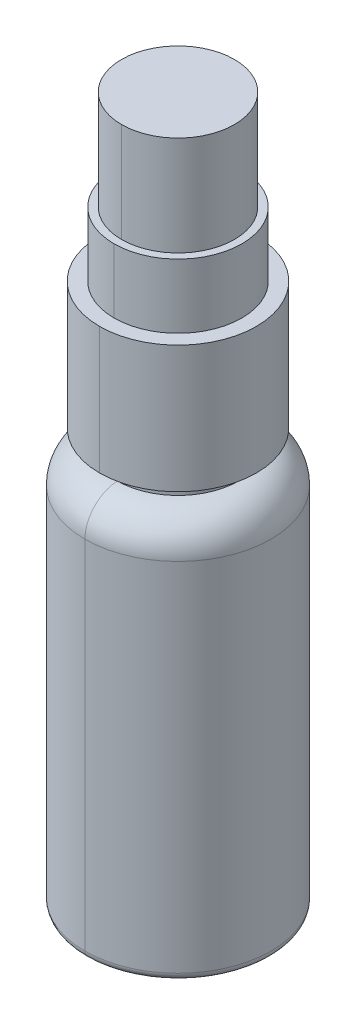
ISO-10303-21;
HEADER;
FILE_DESCRIPTION(('STEP AP214'),'2;1');
FILE_NAME('part.step','',(''),(''),'','','');
FILE_SCHEMA(('AUTOMOTIVE_DESIGN { 1 0 10303 214 1 1 1 1 }'));
ENDSEC;
DATA;
#1=APPLICATION_CONTEXT('core data for automotive mechanical design processes');
#2=APPLICATION_PROTOCOL_DEFINITION('international standard','automotive_design',2000,#1);
#3=PRODUCT_CONTEXT('',#1,'mechanical');
#4=PRODUCT('Part','Part','',(#3));
#5=PRODUCT_RELATED_PRODUCT_CATEGORY('part','',(#4));
#6=PRODUCT_DEFINITION_FORMATION('','',#4);
#7=PRODUCT_DEFINITION_CONTEXT('part definition',#1,'design');
#8=PRODUCT_DEFINITION('design','',#6,#7);
#9=PRODUCT_DEFINITION_SHAPE('','',#8);
#10=(LENGTH_UNIT() NAMED_UNIT(*) SI_UNIT(.MILLI.,.METRE.));
#11=(NAMED_UNIT(*) PLANE_ANGLE_UNIT() SI_UNIT($,.RADIAN.));
#12=(NAMED_UNIT(*) SI_UNIT($,.STERADIAN.) SOLID_ANGLE_UNIT());
#13=UNCERTAINTY_MEASURE_WITH_UNIT(LENGTH_MEASURE(1.E-05),#10,'distance_accuracy_value','');
#14=(GEOMETRIC_REPRESENTATION_CONTEXT(3) GLOBAL_UNCERTAINTY_ASSIGNED_CONTEXT((#13)) GLOBAL_UNIT_ASSIGNED_CONTEXT((#10,
#11,#12)) REPRESENTATION_CONTEXT('',''));
#15=CARTESIAN_POINT('',(0.,0.,0.));
#16=DIRECTION('',(0.,0.,1.));
#17=DIRECTION('',(1.,0.,0.));
#18=AXIS2_PLACEMENT_3D('',#15,#16,#17);
#19=CARTESIAN_POINT('',(0.,46.5,0.));
#20=DIRECTION('',(0.,1.,0.));
#21=DIRECTION('',(0.,0.,1.));
#22=AXIS2_PLACEMENT_3D('',#19,#20,#21);
#23=TOROIDAL_SURFACE('',#22,7.5,4.375);
#24=CARTESIAN_POINT('',(0.,46.5,-7.5));
#25=DIRECTION('',(1.,0.,0.));
#26=DIRECTION('',(0.,0.,-1.));
#27=AXIS2_PLACEMENT_3D('',#24,#25,#26);
#28=CIRCLE('',#27,4.375);
#29=CARTESIAN_POINT('',(0.,46.5,-11.875));
#30=VERTEX_POINT('',#29);
#31=CARTESIAN_POINT('',(0.,50.875,-7.5));
#32=VERTEX_POINT('',#31);
#33=EDGE_CURVE('E360',#30,#32,#28,.T.);
#34=ORIENTED_EDGE('',*,*,#33,.F.);
#35=CARTESIAN_POINT('',(0.,46.5,0.));
#36=DIRECTION('',(0.,1.,0.));
#37=DIRECTION('',(0.,0.,1.));
#38=AXIS2_PLACEMENT_3D('',#35,#36,#37);
#39=CIRCLE('',#38,11.875);
#40=CARTESIAN_POINT('',(0.,46.5,11.875));
#41=VERTEX_POINT('',#40);
#42=EDGE_CURVE('E11',#30,#41,#39,.T.);
#43=ORIENTED_EDGE('',*,*,#42,.T.);
#44=CARTESIAN_POINT('',(0.,46.5,7.5));
#45=DIRECTION('',(-1.,0.,0.));
#46=DIRECTION('',(0.,0.,1.));
#47=AXIS2_PLACEMENT_3D('',#44,#45,#46);
#48=CIRCLE('',#47,4.375);
#49=CARTESIAN_POINT('',(0.,50.875,7.5));
#50=VERTEX_POINT('',#49);
#51=EDGE_CURVE('E200',#41,#50,#48,.T.);
#52=ORIENTED_EDGE('',*,*,#51,.T.);
#53=CARTESIAN_POINT('',(0.,50.875,0.));
#54=DIRECTION('',(0.,1.,0.));
#55=DIRECTION('',(0.,0.,1.));
#56=AXIS2_PLACEMENT_3D('',#53,#54,#55);
#57=CIRCLE('',#56,7.5);
#58=EDGE_CURVE('E246',#32,#50,#57,.T.);
#59=ORIENTED_EDGE('',*,*,#58,.F.);
#60=EDGE_LOOP('',(#34,#43,#52,#59));
#61=FACE_BOUND('',#60,.T.);
#62=ADVANCED_FACE('F16',(#61),#23,.T.);
#63=CARTESIAN_POINT('',(0.,65.8,0.));
#64=DIRECTION('',(0.,1.,0.));
#65=DIRECTION('',(0.,0.,1.));
#66=AXIS2_PLACEMENT_3D('',#63,#64,#65);
#67=CYLINDRICAL_SURFACE('',#66,11.875);
#68=DIRECTION('',(0.,1.,0.));
#69=VECTOR('',#68,1.);
#70=CARTESIAN_POINT('',(0.,65.8,-11.875));
#71=LINE('',#70,#69);
#72=CARTESIAN_POINT('',(0.,1.,-11.875));
#73=VERTEX_POINT('',#72);
#74=EDGE_CURVE('E191',#73,#30,#71,.T.);
#75=ORIENTED_EDGE('',*,*,#74,.F.);
#76=CARTESIAN_POINT('',(0.,1.,0.));
#77=DIRECTION('',(0.,1.,0.));
#78=DIRECTION('',(0.,0.,1.));
#79=AXIS2_PLACEMENT_3D('',#76,#77,#78);
#80=CIRCLE('',#79,11.875);
#81=CARTESIAN_POINT('',(0.,1.,11.875));
#82=VERTEX_POINT('',#81);
#83=EDGE_CURVE('E25',#73,#82,#80,.T.);
#84=ORIENTED_EDGE('',*,*,#83,.T.);
#85=DIRECTION('',(0.,1.,0.));
#86=VECTOR('',#85,1.);
#87=CARTESIAN_POINT('',(0.,65.8,11.875));
#88=LINE('',#87,#86);
#89=EDGE_CURVE('E196',#82,#41,#88,.T.);
#90=ORIENTED_EDGE('',*,*,#89,.T.);
#91=ORIENTED_EDGE('',*,*,#42,.F.);
#92=EDGE_LOOP('',(#75,#84,#90,#91));
#93=FACE_BOUND('',#92,.T.);
#94=ADVANCED_FACE('F18',(#93),#67,.T.);
#95=CARTESIAN_POINT('',(0.,1.,0.));
#96=DIRECTION('',(0.,1.,0.));
#97=DIRECTION('',(0.,0.,1.));
#98=AXIS2_PLACEMENT_3D('',#95,#96,#97);
#99=TOROIDAL_SURFACE('',#98,10.875,1.);
#100=CARTESIAN_POINT('',(0.,1.,-10.875));
#101=DIRECTION('',(1.,0.,0.));
#102=DIRECTION('',(0.,0.,-1.));
#103=AXIS2_PLACEMENT_3D('',#100,#101,#102);
#104=CIRCLE('',#103,1.);
#105=CARTESIAN_POINT('',(0.,0.,-10.875));
#106=VERTEX_POINT('',#105);
#107=EDGE_CURVE('E170',#106,#73,#104,.T.);
#108=ORIENTED_EDGE('',*,*,#107,.F.);
#109=CARTESIAN_POINT('',(0.,0.,0.));
#110=DIRECTION('',(0.,1.,0.));
#111=DIRECTION('',(0.,0.,1.));
#112=AXIS2_PLACEMENT_3D('',#109,#110,#111);
#113=CIRCLE('',#112,10.875);
#114=CARTESIAN_POINT('',(0.,0.,10.875));
#115=VERTEX_POINT('',#114);
#116=EDGE_CURVE('E179',#106,#115,#113,.T.);
#117=ORIENTED_EDGE('',*,*,#116,.T.);
#118=CARTESIAN_POINT('',(0.,1.,10.875));
#119=DIRECTION('',(-1.,0.,0.));
#120=DIRECTION('',(0.,0.,1.));
#121=AXIS2_PLACEMENT_3D('',#118,#119,#120);
#122=CIRCLE('',#121,1.);
#123=EDGE_CURVE('E173',#115,#82,#122,.T.);
#124=ORIENTED_EDGE('',*,*,#123,.T.);
#125=ORIENTED_EDGE('',*,*,#83,.F.);
#126=EDGE_LOOP('',(#108,#117,#124,#125));
#127=FACE_BOUND('',#126,.T.);
#128=ADVANCED_FACE('F169',(#127),#99,.T.);
#129=CARTESIAN_POINT('',(9.75,0.,0.));
#130=DIRECTION('',(0.,1.,0.));
#131=DIRECTION('',(1.,0.,0.));
#132=AXIS2_PLACEMENT_3D('',#129,#130,#131);
#133=PLANE('',#132);
#134=CARTESIAN_POINT('',(0.,0.,0.));
#135=DIRECTION('',(0.,1.,0.));
#136=DIRECTION('',(0.,0.,1.));
#137=AXIS2_PLACEMENT_3D('',#134,#135,#136);
#138=CIRCLE('',#137,9.75);
#139=CARTESIAN_POINT('',(0.,0.,9.75));
#140=VERTEX_POINT('',#139);
#141=CARTESIAN_POINT('',(0.,0.,-9.75));
#142=VERTEX_POINT('',#141);
#143=EDGE_CURVE('E226',#140,#142,#138,.T.);
#144=ORIENTED_EDGE('',*,*,#143,.T.);
#145=CARTESIAN_POINT('',(0.,0.,0.));
#146=DIRECTION('',(0.,1.,0.));
#147=DIRECTION('',(0.,0.,1.));
#148=AXIS2_PLACEMENT_3D('',#145,#146,#147);
#149=CIRCLE('',#148,9.75);
#150=EDGE_CURVE('E346',#142,#140,#149,.T.);
#151=ORIENTED_EDGE('',*,*,#150,.T.);
#152=EDGE_LOOP('',(#144,#151));
#153=FACE_BOUND('',#152,.T.);
#154=CARTESIAN_POINT('',(0.,0.,0.));
#155=DIRECTION('',(0.,1.,0.));
#156=DIRECTION('',(0.,0.,1.));
#157=AXIS2_PLACEMENT_3D('',#154,#155,#156);
#158=CIRCLE('',#157,10.875);
#159=EDGE_CURVE('E187',#115,#106,#158,.T.);
#160=ORIENTED_EDGE('',*,*,#159,.F.);
#161=ORIENTED_EDGE('',*,*,#116,.F.);
#162=EDGE_LOOP('',(#160,#161));
#163=FACE_BOUND('',#162,.T.);
#164=ADVANCED_FACE('F399',(#153,#163),#133,.F.);
#165=CARTESIAN_POINT('',(0.,1.,0.));
#166=DIRECTION('',(0.,1.,0.));
#167=DIRECTION('',(0.,0.,1.));
#168=AXIS2_PLACEMENT_3D('',#165,#166,#167);
#169=TOROIDAL_SURFACE('',#168,9.75,1.);
#170=CARTESIAN_POINT('',(0.,1.,-9.75));
#171=DIRECTION('',(1.,0.,0.));
#172=DIRECTION('',(0.,0.,-1.));
#173=AXIS2_PLACEMENT_3D('',#170,#171,#172);
#174=CIRCLE('',#173,1.);
#175=CARTESIAN_POINT('',(0.,1.,-8.75));
#176=VERTEX_POINT('',#175);
#177=EDGE_CURVE('E230',#176,#142,#174,.T.);
#178=ORIENTED_EDGE('',*,*,#177,.F.);
#179=CARTESIAN_POINT('',(0.,1.,0.));
#180=DIRECTION('',(0.,1.,0.));
#181=DIRECTION('',(0.,0.,1.));
#182=AXIS2_PLACEMENT_3D('',#179,#180,#181);
#183=CIRCLE('',#182,8.75);
#184=CARTESIAN_POINT('',(0.,1.,8.75));
#185=VERTEX_POINT('',#184);
#186=EDGE_CURVE('E211',#176,#185,#183,.T.);
#187=ORIENTED_EDGE('',*,*,#186,.T.);
#188=CARTESIAN_POINT('',(0.,1.,9.75));
#189=DIRECTION('',(-1.,0.,0.));
#190=DIRECTION('',(0.,0.,1.));
#191=AXIS2_PLACEMENT_3D('',#188,#189,#190);
#192=CIRCLE('',#191,1.);
#193=EDGE_CURVE('E216',#185,#140,#192,.T.);
#194=ORIENTED_EDGE('',*,*,#193,.T.);
#195=ORIENTED_EDGE('',*,*,#150,.F.);
#196=EDGE_LOOP('',(#178,#187,#194,#195));
#197=FACE_BOUND('',#196,.T.);
#198=ADVANCED_FACE('F398',(#197),#169,.T.);
#199=CARTESIAN_POINT('',(0.,65.8,0.));
#200=DIRECTION('',(0.,1.,0.));
#201=DIRECTION('',(0.,0.,1.));
#202=AXIS2_PLACEMENT_3D('',#199,#200,#201);
#203=CYLINDRICAL_SURFACE('',#202,8.75);
#204=DIRECTION('',(0.,1.,0.));
#205=VECTOR('',#204,1.);
#206=CARTESIAN_POINT('',(0.,65.8,-8.75));
#207=LINE('',#206,#205);
#208=CARTESIAN_POINT('',(0.,1.40955855165527,-8.75));
#209=VERTEX_POINT('',#208);
#210=EDGE_CURVE('E215',#176,#209,#207,.T.);
#211=ORIENTED_EDGE('',*,*,#210,.F.);
#212=CARTESIAN_POINT('',(0.,1.,0.));
#213=DIRECTION('',(0.,1.,0.));
#214=DIRECTION('',(0.,0.,1.));
#215=AXIS2_PLACEMENT_3D('',#212,#213,#214);
#216=CIRCLE('',#215,8.75);
#217=EDGE_CURVE('E233',#185,#176,#216,.T.);
#218=ORIENTED_EDGE('',*,*,#217,.F.);
#219=DIRECTION('',(0.,1.,0.));
#220=VECTOR('',#219,1.);
#221=CARTESIAN_POINT('',(0.,65.8,8.75));
#222=LINE('',#221,#220);
#223=CARTESIAN_POINT('',(0.,1.40955855165527,8.75));
#224=VERTEX_POINT('',#223);
#225=EDGE_CURVE('E239',#185,#224,#222,.T.);
#226=ORIENTED_EDGE('',*,*,#225,.T.);
#227=CARTESIAN_POINT('',(0.,1.40955855165527,0.));
#228=DIRECTION('',(0.,1.,0.));
#229=DIRECTION('',(0.,0.,1.));
#230=AXIS2_PLACEMENT_3D('',#227,#228,#229);
#231=CIRCLE('',#230,8.75);
#232=EDGE_CURVE('E345',#224,#209,#231,.T.);
#233=ORIENTED_EDGE('',*,*,#232,.T.);
#234=EDGE_LOOP('',(#211,#218,#226,#233));
#235=FACE_BOUND('',#234,.T.);
#236=ADVANCED_FACE('F393',(#235),#203,.F.);
#237=CARTESIAN_POINT('',(0.,1.40955855165527,0.));
#238=DIRECTION('',(0.,1.,0.));
#239=DIRECTION('',(0.,0.,1.));
#240=AXIS2_PLACEMENT_3D('',#237,#238,#239);
#241=TOROIDAL_SURFACE('',#240,7.75,1.);
#242=CARTESIAN_POINT('',(0.,1.40955855165527,-7.75));
#243=DIRECTION('',(1.,0.,0.));
#244=DIRECTION('',(0.,0.,-1.));
#245=AXIS2_PLACEMENT_3D('',#242,#243,#244);
#246=CIRCLE('',#245,1.);
#247=CARTESIAN_POINT('',(0.,2.40955855165527,-7.75));
#248=VERTEX_POINT('',#247);
#249=EDGE_CURVE('E234',#209,#248,#246,.T.);
#250=ORIENTED_EDGE('',*,*,#249,.F.);
#251=ORIENTED_EDGE('',*,*,#232,.F.);
#252=CARTESIAN_POINT('',(0.,1.40955855165527,7.75));
#253=DIRECTION('',(-1.,0.,0.));
#254=DIRECTION('',(0.,0.,1.));
#255=AXIS2_PLACEMENT_3D('',#252,#253,#254);
#256=CIRCLE('',#255,1.);
#257=CARTESIAN_POINT('',(0.,2.40955855165527,7.75));
#258=VERTEX_POINT('',#257);
#259=EDGE_CURVE('E272',#224,#258,#256,.T.);
#260=ORIENTED_EDGE('',*,*,#259,.T.);
#261=CARTESIAN_POINT('',(0.,2.40955855165527,0.));
#262=DIRECTION('',(0.,1.,0.));
#263=DIRECTION('',(0.,0.,1.));
#264=AXIS2_PLACEMENT_3D('',#261,#262,#263);
#265=CIRCLE('',#264,7.75);
#266=EDGE_CURVE('E343',#258,#248,#265,.T.);
#267=ORIENTED_EDGE('',*,*,#266,.T.);
#268=EDGE_LOOP('',(#250,#251,#260,#267));
#269=FACE_BOUND('',#268,.T.);
#270=ADVANCED_FACE('F420',(#269),#241,.F.);
#271=CARTESIAN_POINT('',(7.75,2.40955855165527,0.));
#272=DIRECTION('',(0.,-1.,0.));
#273=DIRECTION('',(0.,0.,-1.));
#274=AXIS2_PLACEMENT_3D('',#271,#272,#273);
#275=PLANE('',#274);
#276=ORIENTED_EDGE('',*,*,#266,.F.);
#277=CARTESIAN_POINT('',(0.,2.40955855165527,0.));
#278=DIRECTION('',(0.,1.,0.));
#279=DIRECTION('',(0.,0.,1.));
#280=AXIS2_PLACEMENT_3D('',#277,#278,#279);
#281=CIRCLE('',#280,7.75);
#282=EDGE_CURVE('E238',#248,#258,#281,.T.);
#283=ORIENTED_EDGE('',*,*,#282,.F.);
#284=EDGE_LOOP('',(#276,#283));
#285=FACE_BOUND('',#284,.T.);
#286=ADVANCED_FACE('F421',(#285),#275,.T.);
#287=CARTESIAN_POINT('',(0.,89.975,0.));
#288=DIRECTION('',(0.,1.,0.));
#289=DIRECTION('',(1.,0.,0.));
#290=AXIS2_PLACEMENT_3D('',#287,#288,#289);
#291=PLANE('',#290);
#292=CARTESIAN_POINT('',(0.,89.975,0.));
#293=DIRECTION('',(0.,1.,0.));
#294=DIRECTION('',(0.,0.,1.));
#295=AXIS2_PLACEMENT_3D('',#292,#293,#294);
#296=CIRCLE('',#295,7.2);
#297=CARTESIAN_POINT('',(0.,89.975,7.2));
#298=VERTEX_POINT('',#297);
#299=CARTESIAN_POINT('',(0.,89.975,-7.2));
#300=VERTEX_POINT('',#299);
#301=EDGE_CURVE('E248',#298,#300,#296,.T.);
#302=ORIENTED_EDGE('',*,*,#301,.T.);
#303=CARTESIAN_POINT('',(0.,89.975,0.));
#304=DIRECTION('',(0.,1.,0.));
#305=DIRECTION('',(0.,0.,1.));
#306=AXIS2_PLACEMENT_3D('',#303,#304,#305);
#307=CIRCLE('',#306,7.2);
#308=EDGE_CURVE('E261',#300,#298,#307,.T.);
#309=ORIENTED_EDGE('',*,*,#308,.T.);
#310=EDGE_LOOP('',(#302,#309));
#311=FACE_BOUND('',#310,.T.);
#312=ADVANCED_FACE('F424',(#311),#291,.T.);
#313=CARTESIAN_POINT('',(0.,65.8,0.));
#314=DIRECTION('',(0.,1.,0.));
#315=DIRECTION('',(0.,0.,1.));
#316=AXIS2_PLACEMENT_3D('',#313,#314,#315);
#317=CYLINDRICAL_SURFACE('',#316,7.2);
#318=DIRECTION('',(0.,1.,0.));
#319=VECTOR('',#318,1.);
#320=CARTESIAN_POINT('',(0.,65.8,-7.2));
#321=LINE('',#320,#319);
#322=CARTESIAN_POINT('',(0.,77.275,-7.2));
#323=VERTEX_POINT('',#322);
#324=EDGE_CURVE('E253',#323,#300,#321,.T.);
#325=ORIENTED_EDGE('',*,*,#324,.F.);
#326=CARTESIAN_POINT('',(0.,77.275,0.));
#327=DIRECTION('',(0.,1.,0.));
#328=DIRECTION('',(0.,0.,1.));
#329=AXIS2_PLACEMENT_3D('',#326,#327,#328);
#330=CIRCLE('',#329,7.2);
#331=CARTESIAN_POINT('',(0.,77.275,7.2));
#332=VERTEX_POINT('',#331);
#333=EDGE_CURVE('E258',#323,#332,#330,.T.);
#334=ORIENTED_EDGE('',*,*,#333,.T.);
#335=DIRECTION('',(0.,1.,0.));
#336=VECTOR('',#335,1.);
#337=CARTESIAN_POINT('',(0.,65.8,7.2));
#338=LINE('',#337,#336);
#339=EDGE_CURVE('E252',#332,#298,#338,.T.);
#340=ORIENTED_EDGE('',*,*,#339,.T.);
#341=ORIENTED_EDGE('',*,*,#308,.F.);
#342=EDGE_LOOP('',(#325,#334,#340,#341));
#343=FACE_BOUND('',#342,.T.);
#344=ADVANCED_FACE('F428',(#343),#317,.T.);
#345=CARTESIAN_POINT('',(8.15,77.275,0.));
#346=DIRECTION('',(0.,-1.,0.));
#347=DIRECTION('',(0.,0.,-1.));
#348=AXIS2_PLACEMENT_3D('',#345,#346,#347);
#349=PLANE('',#348);
#350=CARTESIAN_POINT('',(0.,77.275,0.));
#351=DIRECTION('',(0.,1.,0.));
#352=DIRECTION('',(0.,0.,1.));
#353=AXIS2_PLACEMENT_3D('',#350,#351,#352);
#354=CIRCLE('',#353,7.2);
#355=EDGE_CURVE('E276',#332,#323,#354,.T.);
#356=ORIENTED_EDGE('',*,*,#355,.F.);
#357=ORIENTED_EDGE('',*,*,#333,.F.);
#358=EDGE_LOOP('',(#356,#357));
#359=FACE_BOUND('',#358,.T.);
#360=CARTESIAN_POINT('',(0.,77.275,0.));
#361=DIRECTION('',(0.,1.,0.));
#362=DIRECTION('',(0.,0.,1.));
#363=AXIS2_PLACEMENT_3D('',#360,#361,#362);
#364=CIRCLE('',#363,8.15);
#365=CARTESIAN_POINT('',(0.,77.275,8.15));
#366=VERTEX_POINT('',#365);
#367=CARTESIAN_POINT('',(0.,77.275,-8.15));
#368=VERTEX_POINT('',#367);
#369=EDGE_CURVE('E294',#366,#368,#364,.T.);
#370=ORIENTED_EDGE('',*,*,#369,.T.);
#371=CARTESIAN_POINT('',(0.,77.275,0.));
#372=DIRECTION('',(0.,1.,0.));
#373=DIRECTION('',(0.,0.,1.));
#374=AXIS2_PLACEMENT_3D('',#371,#372,#373);
#375=CIRCLE('',#374,8.15);
#376=EDGE_CURVE('E262',#368,#366,#375,.T.);
#377=ORIENTED_EDGE('',*,*,#376,.T.);
#378=EDGE_LOOP('',(#370,#377));
#379=FACE_BOUND('',#378,.T.);
#380=ADVANCED_FACE('F432',(#359,#379),#349,.F.);
#381=CARTESIAN_POINT('',(0.,65.8,0.));
#382=DIRECTION('',(0.,1.,0.));
#383=DIRECTION('',(0.,0.,1.));
#384=AXIS2_PLACEMENT_3D('',#381,#382,#383);
#385=CYLINDRICAL_SURFACE('',#384,8.15);
#386=DIRECTION('',(0.,1.,0.));
#387=VECTOR('',#386,1.);
#388=CARTESIAN_POINT('',(0.,65.8,-8.15));
#389=LINE('',#388,#387);
#390=CARTESIAN_POINT('',(0.,69.075,-8.15));
#391=VERTEX_POINT('',#390);
#392=EDGE_CURVE('E290',#391,#368,#389,.T.);
#393=ORIENTED_EDGE('',*,*,#392,.F.);
#394=CARTESIAN_POINT('',(0.,69.075,0.));
#395=DIRECTION('',(0.,1.,0.));
#396=DIRECTION('',(0.,0.,1.));
#397=AXIS2_PLACEMENT_3D('',#394,#395,#396);
#398=CIRCLE('',#397,8.15);
#399=CARTESIAN_POINT('',(0.,69.075,8.15));
#400=VERTEX_POINT('',#399);
#401=EDGE_CURVE('E220',#391,#400,#398,.T.);
#402=ORIENTED_EDGE('',*,*,#401,.T.);
#403=DIRECTION('',(0.,1.,0.));
#404=VECTOR('',#403,1.);
#405=CARTESIAN_POINT('',(0.,65.8,8.15));
#406=LINE('',#405,#404);
#407=EDGE_CURVE('E298',#400,#366,#406,.T.);
#408=ORIENTED_EDGE('',*,*,#407,.T.);
#409=ORIENTED_EDGE('',*,*,#376,.F.);
#410=EDGE_LOOP('',(#393,#402,#408,#409));
#411=FACE_BOUND('',#410,.T.);
#412=ADVANCED_FACE('F436',(#411),#385,.T.);
#413=CARTESIAN_POINT('',(10.,69.075,0.));
#414=DIRECTION('',(0.,-1.,0.));
#415=DIRECTION('',(0.,0.,-1.));
#416=AXIS2_PLACEMENT_3D('',#413,#414,#415);
#417=PLANE('',#416);
#418=CARTESIAN_POINT('',(0.,69.075,0.));
#419=DIRECTION('',(0.,1.,0.));
#420=DIRECTION('',(0.,0.,1.));
#421=AXIS2_PLACEMENT_3D('',#418,#419,#420);
#422=CIRCLE('',#421,8.15);
#423=EDGE_CURVE('E286',#400,#391,#422,.T.);
#424=ORIENTED_EDGE('',*,*,#423,.F.);
#425=ORIENTED_EDGE('',*,*,#401,.F.);
#426=EDGE_LOOP('',(#424,#425));
#427=FACE_BOUND('',#426,.T.);
#428=CARTESIAN_POINT('',(0.,69.075,0.));
#429=DIRECTION('',(0.,1.,0.));
#430=DIRECTION('',(0.,0.,1.));
#431=AXIS2_PLACEMENT_3D('',#428,#429,#430);
#432=CIRCLE('',#431,10.);
#433=CARTESIAN_POINT('',(0.,69.075,10.));
#434=VERTEX_POINT('',#433);
#435=CARTESIAN_POINT('',(0.,69.075,-10.));
#436=VERTEX_POINT('',#435);
#437=EDGE_CURVE('E310',#434,#436,#432,.T.);
#438=ORIENTED_EDGE('',*,*,#437,.T.);
#439=CARTESIAN_POINT('',(0.,69.075,0.));
#440=DIRECTION('',(0.,1.,0.));
#441=DIRECTION('',(0.,0.,1.));
#442=AXIS2_PLACEMENT_3D('',#439,#440,#441);
#443=CIRCLE('',#442,10.);
#444=EDGE_CURVE('E217',#436,#434,#443,.T.);
#445=ORIENTED_EDGE('',*,*,#444,.T.);
#446=EDGE_LOOP('',(#438,#445));
#447=FACE_BOUND('',#446,.T.);
#448=ADVANCED_FACE('F438',(#427,#447),#417,.F.);
#449=CARTESIAN_POINT('',(0.,65.8,0.));
#450=DIRECTION('',(0.,1.,0.));
#451=DIRECTION('',(0.,0.,1.));
#452=AXIS2_PLACEMENT_3D('',#449,#450,#451);
#453=CYLINDRICAL_SURFACE('',#452,10.);
#454=DIRECTION('',(0.,1.,0.));
#455=VECTOR('',#454,1.);
#456=CARTESIAN_POINT('',(0.,65.8,-10.));
#457=LINE('',#456,#455);
#458=CARTESIAN_POINT('',(0.,52.875,-10.));
#459=VERTEX_POINT('',#458);
#460=EDGE_CURVE('E306',#459,#436,#457,.T.);
#461=ORIENTED_EDGE('',*,*,#460,.F.);
#462=CARTESIAN_POINT('',(0.,52.875,0.));
#463=DIRECTION('',(0.,1.,0.));
#464=DIRECTION('',(0.,0.,1.));
#465=AXIS2_PLACEMENT_3D('',#462,#463,#464);
#466=CIRCLE('',#465,10.);
#467=CARTESIAN_POINT('',(0.,52.875,10.));
#468=VERTEX_POINT('',#467);
#469=EDGE_CURVE('E221',#459,#468,#466,.T.);
#470=ORIENTED_EDGE('',*,*,#469,.T.);
#471=DIRECTION('',(0.,1.,0.));
#472=VECTOR('',#471,1.);
#473=CARTESIAN_POINT('',(0.,65.8,10.));
#474=LINE('',#473,#472);
#475=EDGE_CURVE('E314',#468,#434,#474,.T.);
#476=ORIENTED_EDGE('',*,*,#475,.T.);
#477=ORIENTED_EDGE('',*,*,#444,.F.);
#478=EDGE_LOOP('',(#461,#470,#476,#477));
#479=FACE_BOUND('',#478,.T.);
#480=ADVANCED_FACE('F441',(#479),#453,.T.);
#481=CARTESIAN_POINT('',(7.75,52.875,0.));
#482=DIRECTION('',(0.,1.,0.));
#483=DIRECTION('',(1.,0.,0.));
#484=AXIS2_PLACEMENT_3D('',#481,#482,#483);
#485=PLANE('',#484);
#486=CARTESIAN_POINT('',(0.,52.875,0.));
#487=DIRECTION('',(0.,1.,0.));
#488=DIRECTION('',(0.,0.,1.));
#489=AXIS2_PLACEMENT_3D('',#486,#487,#488);
#490=CIRCLE('',#489,7.75);
#491=CARTESIAN_POINT('',(0.,52.875,7.75));
#492=VERTEX_POINT('',#491);
#493=CARTESIAN_POINT('',(0.,52.875,-7.75));
#494=VERTEX_POINT('',#493);
#495=EDGE_CURVE('E326',#492,#494,#490,.T.);
#496=ORIENTED_EDGE('',*,*,#495,.T.);
#497=CARTESIAN_POINT('',(0.,52.875,0.));
#498=DIRECTION('',(0.,1.,0.));
#499=DIRECTION('',(0.,0.,1.));
#500=AXIS2_PLACEMENT_3D('',#497,#498,#499);
#501=CIRCLE('',#500,7.75);
#502=EDGE_CURVE('E37',#494,#492,#501,.T.);
#503=ORIENTED_EDGE('',*,*,#502,.T.);
#504=EDGE_LOOP('',(#496,#503));
#505=FACE_BOUND('',#504,.T.);
#506=CARTESIAN_POINT('',(0.,52.875,0.));
#507=DIRECTION('',(0.,1.,0.));
#508=DIRECTION('',(0.,0.,1.));
#509=AXIS2_PLACEMENT_3D('',#506,#507,#508);
#510=CIRCLE('',#509,10.);
#511=EDGE_CURVE('E302',#468,#459,#510,.T.);
#512=ORIENTED_EDGE('',*,*,#511,.F.);
#513=ORIENTED_EDGE('',*,*,#469,.F.);
#514=EDGE_LOOP('',(#512,#513));
#515=FACE_BOUND('',#514,.T.);
#516=ADVANCED_FACE('F443',(#505,#515),#485,.F.);
#517=CARTESIAN_POINT('',(0.,65.8,0.));
#518=DIRECTION('',(0.,1.,0.));
#519=DIRECTION('',(0.,0.,1.));
#520=AXIS2_PLACEMENT_3D('',#517,#518,#519);
#521=CYLINDRICAL_SURFACE('',#520,7.75);
#522=DIRECTION('',(0.,1.,0.));
#523=VECTOR('',#522,1.);
#524=CARTESIAN_POINT('',(0.,65.8,-7.75));
#525=LINE('',#524,#523);
#526=CARTESIAN_POINT('',(0.,50.875,-7.75));
#527=VERTEX_POINT('',#526);
#528=EDGE_CURVE('E322',#527,#494,#525,.T.);
#529=ORIENTED_EDGE('',*,*,#528,.F.);
#530=CARTESIAN_POINT('',(0.,50.875,0.));
#531=DIRECTION('',(0.,1.,0.));
#532=DIRECTION('',(0.,0.,1.));
#533=AXIS2_PLACEMENT_3D('',#530,#531,#532);
#534=CIRCLE('',#533,7.75);
#535=CARTESIAN_POINT('',(0.,50.875,7.75));
#536=VERTEX_POINT('',#535);
#537=EDGE_CURVE('E243',#527,#536,#534,.T.);
#538=ORIENTED_EDGE('',*,*,#537,.T.);
#539=DIRECTION('',(0.,1.,0.));
#540=VECTOR('',#539,1.);
#541=CARTESIAN_POINT('',(0.,65.8,7.75));
#542=LINE('',#541,#540);
#543=EDGE_CURVE('E247',#536,#492,#542,.T.);
#544=ORIENTED_EDGE('',*,*,#543,.T.);
#545=ORIENTED_EDGE('',*,*,#502,.F.);
#546=EDGE_LOOP('',(#529,#538,#544,#545));
#547=FACE_BOUND('',#546,.T.);
#548=ADVANCED_FACE('F446',(#547),#521,.T.);
#549=CARTESIAN_POINT('',(7.5,50.875,0.));
#550=DIRECTION('',(0.,1.,0.));
#551=DIRECTION('',(1.,0.,0.));
#552=AXIS2_PLACEMENT_3D('',#549,#550,#551);
#553=PLANE('',#552);
#554=CARTESIAN_POINT('',(0.,50.875,0.));
#555=DIRECTION('',(0.,1.,0.));
#556=DIRECTION('',(0.,0.,1.));
#557=AXIS2_PLACEMENT_3D('',#554,#555,#556);
#558=CIRCLE('',#557,7.5);
#559=EDGE_CURVE('E207',#50,#32,#558,.T.);
#560=ORIENTED_EDGE('',*,*,#559,.T.);
#561=ORIENTED_EDGE('',*,*,#58,.T.);
#562=EDGE_LOOP('',(#560,#561));
#563=FACE_BOUND('',#562,.T.);
#564=CARTESIAN_POINT('',(0.,50.875,0.));
#565=DIRECTION('',(0.,1.,0.));
#566=DIRECTION('',(0.,0.,1.));
#567=AXIS2_PLACEMENT_3D('',#564,#565,#566);
#568=CIRCLE('',#567,7.75);
#569=EDGE_CURVE('E318',#536,#527,#568,.T.);
#570=ORIENTED_EDGE('',*,*,#569,.F.);
#571=ORIENTED_EDGE('',*,*,#537,.F.);
#572=EDGE_LOOP('',(#570,#571));
#573=FACE_BOUND('',#572,.T.);
#574=ADVANCED_FACE('F452',(#563,#573),#553,.F.);
#575=CARTESIAN_POINT('',(0.,65.8,0.));
#576=DIRECTION('',(0.,1.,0.));
#577=DIRECTION('',(0.,0.,1.));
#578=AXIS2_PLACEMENT_3D('',#575,#576,#577);
#579=CYLINDRICAL_SURFACE('',#578,7.75);
#580=ORIENTED_EDGE('',*,*,#569,.T.);
#581=ORIENTED_EDGE('',*,*,#528,.T.);
#582=ORIENTED_EDGE('',*,*,#495,.F.);
#583=ORIENTED_EDGE('',*,*,#543,.F.);
#584=EDGE_LOOP('',(#580,#581,#582,#583));
#585=FACE_BOUND('',#584,.T.);
#586=ADVANCED_FACE('F454',(#585),#579,.T.);
#587=CARTESIAN_POINT('',(0.,65.8,0.));
#588=DIRECTION('',(0.,1.,0.));
#589=DIRECTION('',(0.,0.,1.));
#590=AXIS2_PLACEMENT_3D('',#587,#588,#589);
#591=CYLINDRICAL_SURFACE('',#590,10.);
#592=ORIENTED_EDGE('',*,*,#511,.T.);
#593=ORIENTED_EDGE('',*,*,#460,.T.);
#594=ORIENTED_EDGE('',*,*,#437,.F.);
#595=ORIENTED_EDGE('',*,*,#475,.F.);
#596=EDGE_LOOP('',(#592,#593,#594,#595));
#597=FACE_BOUND('',#596,.T.);
#598=ADVANCED_FACE('F459',(#597),#591,.T.);
#599=CARTESIAN_POINT('',(0.,65.8,0.));
#600=DIRECTION('',(0.,1.,0.));
#601=DIRECTION('',(0.,0.,1.));
#602=AXIS2_PLACEMENT_3D('',#599,#600,#601);
#603=CYLINDRICAL_SURFACE('',#602,8.15);
#604=ORIENTED_EDGE('',*,*,#423,.T.);
#605=ORIENTED_EDGE('',*,*,#392,.T.);
#606=ORIENTED_EDGE('',*,*,#369,.F.);
#607=ORIENTED_EDGE('',*,*,#407,.F.);
#608=EDGE_LOOP('',(#604,#605,#606,#607));
#609=FACE_BOUND('',#608,.T.);
#610=ADVANCED_FACE('F475',(#609),#603,.T.);
#611=CARTESIAN_POINT('',(0.,65.8,0.));
#612=DIRECTION('',(0.,1.,0.));
#613=DIRECTION('',(0.,0.,1.));
#614=AXIS2_PLACEMENT_3D('',#611,#612,#613);
#615=CYLINDRICAL_SURFACE('',#614,7.2);
#616=ORIENTED_EDGE('',*,*,#355,.T.);
#617=ORIENTED_EDGE('',*,*,#324,.T.);
#618=ORIENTED_EDGE('',*,*,#301,.F.);
#619=ORIENTED_EDGE('',*,*,#339,.F.);
#620=EDGE_LOOP('',(#616,#617,#618,#619));
#621=FACE_BOUND('',#620,.T.);
#622=ADVANCED_FACE('F480',(#621),#615,.T.);
#623=CARTESIAN_POINT('',(0.,1.40955855165527,0.));
#624=DIRECTION('',(0.,1.,0.));
#625=DIRECTION('',(0.,0.,1.));
#626=AXIS2_PLACEMENT_3D('',#623,#624,#625);
#627=TOROIDAL_SURFACE('',#626,7.75,1.);
#628=CARTESIAN_POINT('',(0.,1.40955855165527,0.));
#629=DIRECTION('',(0.,1.,0.));
#630=DIRECTION('',(0.,0.,1.));
#631=AXIS2_PLACEMENT_3D('',#628,#629,#630);
#632=CIRCLE('',#631,8.75);
#633=EDGE_CURVE('E257',#209,#224,#632,.T.);
#634=ORIENTED_EDGE('',*,*,#633,.F.);
#635=ORIENTED_EDGE('',*,*,#249,.T.);
#636=ORIENTED_EDGE('',*,*,#282,.T.);
#637=ORIENTED_EDGE('',*,*,#259,.F.);
#638=EDGE_LOOP('',(#634,#635,#636,#637));
#639=FACE_BOUND('',#638,.T.);
#640=ADVANCED_FACE('F491',(#639),#627,.F.);
#641=CARTESIAN_POINT('',(0.,65.8,0.));
#642=DIRECTION('',(0.,1.,0.));
#643=DIRECTION('',(0.,0.,1.));
#644=AXIS2_PLACEMENT_3D('',#641,#642,#643);
#645=CYLINDRICAL_SURFACE('',#644,8.75);
#646=ORIENTED_EDGE('',*,*,#186,.F.);
#647=ORIENTED_EDGE('',*,*,#210,.T.);
#648=ORIENTED_EDGE('',*,*,#633,.T.);
#649=ORIENTED_EDGE('',*,*,#225,.F.);
#650=EDGE_LOOP('',(#646,#647,#648,#649));
#651=FACE_BOUND('',#650,.T.);
#652=ADVANCED_FACE('F396',(#651),#645,.F.);
#653=CARTESIAN_POINT('',(0.,1.,0.));
#654=DIRECTION('',(0.,1.,0.));
#655=DIRECTION('',(0.,0.,1.));
#656=AXIS2_PLACEMENT_3D('',#653,#654,#655);
#657=TOROIDAL_SURFACE('',#656,9.75,1.);
#658=ORIENTED_EDGE('',*,*,#217,.T.);
#659=ORIENTED_EDGE('',*,*,#177,.T.);
#660=ORIENTED_EDGE('',*,*,#143,.F.);
#661=ORIENTED_EDGE('',*,*,#193,.F.);
#662=EDGE_LOOP('',(#658,#659,#660,#661));
#663=FACE_BOUND('',#662,.T.);
#664=ADVANCED_FACE('F390',(#663),#657,.T.);
#665=CARTESIAN_POINT('',(0.,1.,0.));
#666=DIRECTION('',(0.,1.,0.));
#667=DIRECTION('',(0.,0.,1.));
#668=AXIS2_PLACEMENT_3D('',#665,#666,#667);
#669=TOROIDAL_SURFACE('',#668,10.875,1.);
#670=ORIENTED_EDGE('',*,*,#159,.T.);
#671=ORIENTED_EDGE('',*,*,#107,.T.);
#672=CARTESIAN_POINT('',(0.,1.,0.));
#673=DIRECTION('',(0.,1.,0.));
#674=DIRECTION('',(0.,0.,1.));
#675=AXIS2_PLACEMENT_3D('',#672,#673,#674);
#676=CIRCLE('',#675,11.875);
#677=EDGE_CURVE('E185',#82,#73,#676,.T.);
#678=ORIENTED_EDGE('',*,*,#677,.F.);
#679=ORIENTED_EDGE('',*,*,#123,.F.);
#680=EDGE_LOOP('',(#670,#671,#678,#679));
#681=FACE_BOUND('',#680,.T.);
#682=ADVANCED_FACE('F183',(#681),#669,.T.);
#683=CARTESIAN_POINT('',(0.,65.8,0.));
#684=DIRECTION('',(0.,1.,0.));
#685=DIRECTION('',(0.,0.,1.));
#686=AXIS2_PLACEMENT_3D('',#683,#684,#685);
#687=CYLINDRICAL_SURFACE('',#686,11.875);
#688=ORIENTED_EDGE('',*,*,#677,.T.);
#689=ORIENTED_EDGE('',*,*,#74,.T.);
#690=CARTESIAN_POINT('',(0.,46.5,0.));
#691=DIRECTION('',(0.,1.,0.));
#692=DIRECTION('',(0.,0.,1.));
#693=AXIS2_PLACEMENT_3D('',#690,#691,#692);
#694=CIRCLE('',#693,11.875);
#695=EDGE_CURVE('E370',#41,#30,#694,.T.);
#696=ORIENTED_EDGE('',*,*,#695,.F.);
#697=ORIENTED_EDGE('',*,*,#89,.F.);
#698=EDGE_LOOP('',(#688,#689,#696,#697));
#699=FACE_BOUND('',#698,.T.);
#700=ADVANCED_FACE('F198',(#699),#687,.T.);
#701=CARTESIAN_POINT('',(0.,46.5,0.));
#702=DIRECTION('',(0.,1.,0.));
#703=DIRECTION('',(0.,0.,1.));
#704=AXIS2_PLACEMENT_3D('',#701,#702,#703);
#705=TOROIDAL_SURFACE('',#704,7.5,4.375);
#706=ORIENTED_EDGE('',*,*,#695,.T.);
#707=ORIENTED_EDGE('',*,*,#33,.T.);
#708=ORIENTED_EDGE('',*,*,#559,.F.);
#709=ORIENTED_EDGE('',*,*,#51,.F.);
#710=EDGE_LOOP('',(#706,#707,#708,#709));
#711=FACE_BOUND('',#710,.T.);
#712=ADVANCED_FACE('F484',(#711),#705,.T.);
#713=CLOSED_SHELL('',(#62,#94,#128,#164,#198,#236,#270,#286,#312,#344,#380,#412,#448,#480,#516,
#548,#574,#586,#598,#610,#622,#640,#652,#664,#682,#700,#712));
#714=MANIFOLD_SOLID_BREP('B1',#713);
#715=ADVANCED_BREP_SHAPE_REPRESENTATION('',(#18,#714),#14);
#716=SHAPE_DEFINITION_REPRESENTATION(#9,#715);
ENDSEC;
END-ISO-10303-21;
